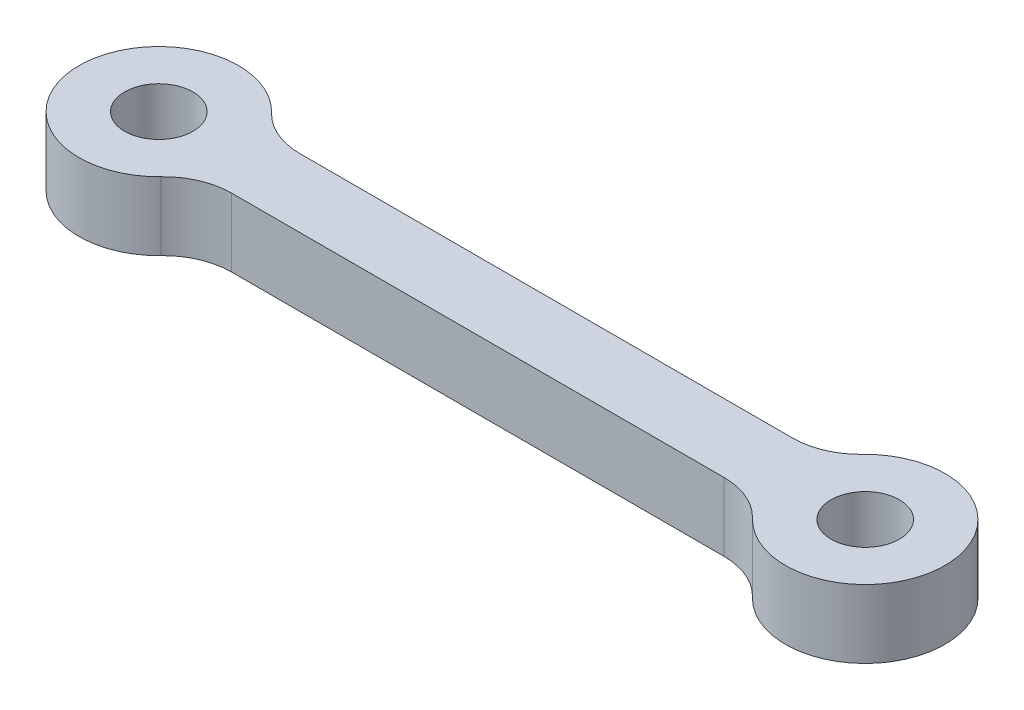
ISO-10303-21;
HEADER;
FILE_DESCRIPTION(('STEP AP214'),'2;1');
FILE_NAME('part.step','',(''),(''),'','','');
FILE_SCHEMA(('AUTOMOTIVE_DESIGN { 1 0 10303 214 1 1 1 1 }'));
ENDSEC;
DATA;
#1=APPLICATION_CONTEXT('core data for automotive mechanical design processes');
#2=APPLICATION_PROTOCOL_DEFINITION('international standard','automotive_design',2000,#1);
#3=PRODUCT_CONTEXT('',#1,'mechanical');
#4=PRODUCT('Part','Part','',(#3));
#5=PRODUCT_RELATED_PRODUCT_CATEGORY('part','',(#4));
#6=PRODUCT_DEFINITION_FORMATION('','',#4);
#7=PRODUCT_DEFINITION_CONTEXT('part definition',#1,'design');
#8=PRODUCT_DEFINITION('design','',#6,#7);
#9=PRODUCT_DEFINITION_SHAPE('','',#8);
#10=(LENGTH_UNIT() NAMED_UNIT(*) SI_UNIT(.MILLI.,.METRE.));
#11=(NAMED_UNIT(*) PLANE_ANGLE_UNIT() SI_UNIT($,.RADIAN.));
#12=(NAMED_UNIT(*) SI_UNIT($,.STERADIAN.) SOLID_ANGLE_UNIT());
#13=UNCERTAINTY_MEASURE_WITH_UNIT(LENGTH_MEASURE(1.E-05),#10,'distance_accuracy_value','');
#14=(GEOMETRIC_REPRESENTATION_CONTEXT(3) GLOBAL_UNCERTAINTY_ASSIGNED_CONTEXT((#13)) GLOBAL_UNIT_ASSIGNED_CONTEXT((#10,
#11,#12)) REPRESENTATION_CONTEXT('',''));
#15=CARTESIAN_POINT('',(0.,0.,0.));
#16=DIRECTION('',(0.,0.,1.));
#17=DIRECTION('',(1.,0.,0.));
#18=AXIS2_PLACEMENT_3D('',#15,#16,#17);
#19=CARTESIAN_POINT('',(31.,3.,0.));
#20=DIRECTION('',(0.,-1.,0.));
#21=DIRECTION('',(0.,0.,-1.));
#22=AXIS2_PLACEMENT_3D('',#19,#20,#21);
#23=CYLINDRICAL_SURFACE('',#22,3.5);
#24=CARTESIAN_POINT('',(31.,3.,0.));
#25=DIRECTION('',(0.,1.,0.));
#26=DIRECTION('',(0.,0.,1.));
#27=AXIS2_PLACEMENT_3D('',#24,#25,#26);
#28=CIRCLE('',#27,3.5);
#29=CARTESIAN_POINT('',(28.4743915139412,3.,2.42307692307692));
#30=VERTEX_POINT('',#29);
#31=CARTESIAN_POINT('',(28.4743915139412,3.,-2.42307692307692));
#32=VERTEX_POINT('',#31);
#33=EDGE_CURVE('E140',#30,#32,#28,.T.);
#34=ORIENTED_EDGE('',*,*,#33,.F.);
#35=DIRECTION('',(0.,-1.,0.));
#36=VECTOR('',#35,1.);
#37=CARTESIAN_POINT('',(28.4743915139412,3.,2.42307692307692));
#38=LINE('',#37,#36);
#39=CARTESIAN_POINT('',(28.4743915139412,0.,2.42307692307692));
#40=VERTEX_POINT('',#39);
#41=EDGE_CURVE('E148',#30,#40,#38,.T.);
#42=ORIENTED_EDGE('',*,*,#41,.T.);
#43=CARTESIAN_POINT('',(31.,0.,0.));
#44=DIRECTION('',(0.,1.,0.));
#45=DIRECTION('',(0.,0.,1.));
#46=AXIS2_PLACEMENT_3D('',#43,#44,#45);
#47=CIRCLE('',#46,3.5);
#48=CARTESIAN_POINT('',(28.4743915139412,0.,-2.42307692307692));
#49=VERTEX_POINT('',#48);
#50=EDGE_CURVE('E165',#40,#49,#47,.T.);
#51=ORIENTED_EDGE('',*,*,#50,.T.);
#52=DIRECTION('',(0.,-1.,0.));
#53=VECTOR('',#52,1.);
#54=CARTESIAN_POINT('',(28.4743915139412,3.,-2.42307692307692));
#55=LINE('',#54,#53);
#56=EDGE_CURVE('E146',#49,#32,#55,.F.);
#57=ORIENTED_EDGE('',*,*,#56,.T.);
#58=EDGE_LOOP('',(#34,#42,#51,#57));
#59=FACE_BOUND('',#58,.T.);
#60=ADVANCED_FACE('F34',(#59),#23,.T.);
#61=CARTESIAN_POINT('',(-14.6957887593287,3.,-1.5));
#62=DIRECTION('',(0.,0.,-1.));
#63=DIRECTION('',(-1.,0.,0.));
#64=AXIS2_PLACEMENT_3D('',#61,#62,#63);
#65=PLANE('',#64);
#66=DIRECTION('',(1.,0.,0.));
#67=VECTOR('',#66,1.);
#68=CARTESIAN_POINT('',(-14.6957887593287,3.,-1.5));
#69=LINE('',#68,#67);
#70=CARTESIAN_POINT('',(4.69041575982343,3.,-1.5));
#71=VERTEX_POINT('',#70);
#72=CARTESIAN_POINT('',(26.3095842401766,3.,-1.5));
#73=VERTEX_POINT('',#72);
#74=EDGE_CURVE('E172',#71,#73,#69,.T.);
#75=ORIENTED_EDGE('',*,*,#74,.T.);
#76=DIRECTION('',(0.,-1.,0.));
#77=VECTOR('',#76,1.);
#78=CARTESIAN_POINT('',(26.3095842401766,3.,-1.5));
#79=LINE('',#78,#77);
#80=CARTESIAN_POINT('',(26.3095842401766,0.,-1.5));
#81=VERTEX_POINT('',#80);
#82=EDGE_CURVE('E111',#73,#81,#79,.T.);
#83=ORIENTED_EDGE('',*,*,#82,.T.);
#84=DIRECTION('',(1.,0.,0.));
#85=VECTOR('',#84,1.);
#86=CARTESIAN_POINT('',(-14.6957887593287,0.,-1.5));
#87=LINE('',#86,#85);
#88=CARTESIAN_POINT('',(4.69041575982343,0.,-1.5));
#89=VERTEX_POINT('',#88);
#90=EDGE_CURVE('E134',#89,#81,#87,.T.);
#91=ORIENTED_EDGE('',*,*,#90,.F.);
#92=DIRECTION('',(0.,-1.,0.));
#93=VECTOR('',#92,1.);
#94=CARTESIAN_POINT('',(4.69041575982343,3.,-1.5));
#95=LINE('',#94,#93);
#96=EDGE_CURVE('E56',#89,#71,#95,.F.);
#97=ORIENTED_EDGE('',*,*,#96,.T.);
#98=EDGE_LOOP('',(#75,#83,#91,#97));
#99=FACE_BOUND('',#98,.T.);
#100=ADVANCED_FACE('F163',(#99),#65,.T.);
#101=CARTESIAN_POINT('',(0.,3.,0.));
#102=DIRECTION('',(0.,-1.,0.));
#103=DIRECTION('',(0.,0.,-1.));
#104=AXIS2_PLACEMENT_3D('',#101,#102,#103);
#105=CYLINDRICAL_SURFACE('',#104,3.5);
#106=CARTESIAN_POINT('',(0.,0.,0.));
#107=DIRECTION('',(0.,1.,0.));
#108=DIRECTION('',(0.,0.,1.));
#109=AXIS2_PLACEMENT_3D('',#106,#107,#108);
#110=CIRCLE('',#109,3.5);
#111=CARTESIAN_POINT('',(2.52560848605877,0.,-2.42307692307692));
#112=VERTEX_POINT('',#111);
#113=CARTESIAN_POINT('',(2.52560848605877,0.,2.42307692307692));
#114=VERTEX_POINT('',#113);
#115=EDGE_CURVE('E129',#112,#114,#110,.T.);
#116=ORIENTED_EDGE('',*,*,#115,.T.);
#117=DIRECTION('',(0.,-1.,0.));
#118=VECTOR('',#117,1.);
#119=CARTESIAN_POINT('',(2.52560848605877,3.,2.42307692307692));
#120=LINE('',#119,#118);
#121=CARTESIAN_POINT('',(2.52560848605877,3.,2.42307692307692));
#122=VERTEX_POINT('',#121);
#123=EDGE_CURVE('E105',#114,#122,#120,.F.);
#124=ORIENTED_EDGE('',*,*,#123,.T.);
#125=CARTESIAN_POINT('',(0.,3.,0.));
#126=DIRECTION('',(0.,1.,0.));
#127=DIRECTION('',(0.,0.,1.));
#128=AXIS2_PLACEMENT_3D('',#125,#126,#127);
#129=CIRCLE('',#128,3.5);
#130=CARTESIAN_POINT('',(2.52560848605877,3.,-2.42307692307692));
#131=VERTEX_POINT('',#130);
#132=EDGE_CURVE('E171',#131,#122,#129,.T.);
#133=ORIENTED_EDGE('',*,*,#132,.F.);
#134=DIRECTION('',(0.,-1.,0.));
#135=VECTOR('',#134,1.);
#136=CARTESIAN_POINT('',(2.52560848605877,3.,-2.42307692307692));
#137=LINE('',#136,#135);
#138=EDGE_CURVE('E121',#131,#112,#137,.T.);
#139=ORIENTED_EDGE('',*,*,#138,.T.);
#140=EDGE_LOOP('',(#116,#124,#133,#139));
#141=FACE_BOUND('',#140,.T.);
#142=ADVANCED_FACE('F174',(#141),#105,.T.);
#143=CARTESIAN_POINT('',(0.,3.,0.));
#144=DIRECTION('',(0.,-1.,0.));
#145=DIRECTION('',(0.,0.,-1.));
#146=AXIS2_PLACEMENT_3D('',#143,#144,#145);
#147=CYLINDRICAL_SURFACE('',#146,1.5);
#148=CARTESIAN_POINT('',(0.,3.,0.));
#149=DIRECTION('',(0.,1.,0.));
#150=DIRECTION('',(0.,0.,1.));
#151=AXIS2_PLACEMENT_3D('',#148,#149,#150);
#152=CIRCLE('',#151,1.5);
#153=CARTESIAN_POINT('',(0.,3.,1.5));
#154=VERTEX_POINT('',#153);
#155=EDGE_CURVE('E176',#154,#154,#152,.T.);
#156=ORIENTED_EDGE('',*,*,#155,.T.);
#157=EDGE_LOOP('',(#156));
#158=FACE_BOUND('',#157,.T.);
#159=CARTESIAN_POINT('',(0.,0.,0.));
#160=DIRECTION('',(0.,1.,0.));
#161=DIRECTION('',(0.,0.,1.));
#162=AXIS2_PLACEMENT_3D('',#159,#160,#161);
#163=CIRCLE('',#162,1.5);
#164=CARTESIAN_POINT('',(0.,0.,1.5));
#165=VERTEX_POINT('',#164);
#166=EDGE_CURVE('E128',#165,#165,#163,.T.);
#167=ORIENTED_EDGE('',*,*,#166,.F.);
#168=EDGE_LOOP('',(#167));
#169=FACE_BOUND('',#168,.T.);
#170=ADVANCED_FACE('F222',(#158,#169),#147,.F.);
#171=CARTESIAN_POINT('',(-14.6957887593287,3.,1.5));
#172=DIRECTION('',(0.,0.,-1.));
#173=DIRECTION('',(-1.,0.,0.));
#174=AXIS2_PLACEMENT_3D('',#171,#172,#173);
#175=PLANE('',#174);
#176=DIRECTION('',(1.,0.,0.));
#177=VECTOR('',#176,1.);
#178=CARTESIAN_POINT('',(-14.6957887593287,3.,1.5));
#179=LINE('',#178,#177);
#180=CARTESIAN_POINT('',(4.69041575982343,3.,1.5));
#181=VERTEX_POINT('',#180);
#182=CARTESIAN_POINT('',(26.3095842401766,3.,1.5));
#183=VERTEX_POINT('',#182);
#184=EDGE_CURVE('E120',#181,#183,#179,.T.);
#185=ORIENTED_EDGE('',*,*,#184,.F.);
#186=DIRECTION('',(0.,1.,0.));
#187=VECTOR('',#186,1.);
#188=CARTESIAN_POINT('',(4.69041575982343,0.,1.5));
#189=LINE('',#188,#187);
#190=CARTESIAN_POINT('',(4.69041575982343,0.,1.5));
#191=VERTEX_POINT('',#190);
#192=EDGE_CURVE('E104',#181,#191,#189,.F.);
#193=ORIENTED_EDGE('',*,*,#192,.T.);
#194=DIRECTION('',(1.,0.,0.));
#195=VECTOR('',#194,1.);
#196=CARTESIAN_POINT('',(-14.6957887593287,0.,1.5));
#197=LINE('',#196,#195);
#198=CARTESIAN_POINT('',(26.3095842401766,0.,1.5));
#199=VERTEX_POINT('',#198);
#200=EDGE_CURVE('E117',#191,#199,#197,.T.);
#201=ORIENTED_EDGE('',*,*,#200,.T.);
#202=DIRECTION('',(0.,1.,0.));
#203=VECTOR('',#202,1.);
#204=CARTESIAN_POINT('',(26.3095842401766,3.,1.5));
#205=LINE('',#204,#203);
#206=EDGE_CURVE('E122',#199,#183,#205,.T.);
#207=ORIENTED_EDGE('',*,*,#206,.T.);
#208=EDGE_LOOP('',(#185,#193,#201,#207));
#209=FACE_BOUND('',#208,.T.);
#210=ADVANCED_FACE('F116',(#209),#175,.F.);
#211=CARTESIAN_POINT('',(31.,3.,0.));
#212=DIRECTION('',(0.,-1.,0.));
#213=DIRECTION('',(0.,0.,-1.));
#214=AXIS2_PLACEMENT_3D('',#211,#212,#213);
#215=CYLINDRICAL_SURFACE('',#214,1.5);
#216=CARTESIAN_POINT('',(31.,3.,0.));
#217=DIRECTION('',(0.,1.,0.));
#218=DIRECTION('',(0.,0.,1.));
#219=AXIS2_PLACEMENT_3D('',#216,#217,#218);
#220=CIRCLE('',#219,1.5);
#221=CARTESIAN_POINT('',(31.,3.,1.5));
#222=VERTEX_POINT('',#221);
#223=EDGE_CURVE('E141',#222,#222,#220,.T.);
#224=ORIENTED_EDGE('',*,*,#223,.T.);
#225=EDGE_LOOP('',(#224));
#226=FACE_BOUND('',#225,.T.);
#227=CARTESIAN_POINT('',(31.,0.,0.));
#228=DIRECTION('',(0.,1.,0.));
#229=DIRECTION('',(0.,0.,1.));
#230=AXIS2_PLACEMENT_3D('',#227,#228,#229);
#231=CIRCLE('',#230,1.5);
#232=CARTESIAN_POINT('',(31.,0.,1.5));
#233=VERTEX_POINT('',#232);
#234=EDGE_CURVE('E132',#233,#233,#231,.T.);
#235=ORIENTED_EDGE('',*,*,#234,.F.);
#236=EDGE_LOOP('',(#235));
#237=FACE_BOUND('',#236,.T.);
#238=ADVANCED_FACE('F216',(#226,#237),#215,.F.);
#239=CARTESIAN_POINT('',(-14.6957887593287,3.,0.));
#240=DIRECTION('',(0.,1.,0.));
#241=DIRECTION('',(0.,0.,1.));
#242=AXIS2_PLACEMENT_3D('',#239,#240,#241);
#243=PLANE('',#242);
#244=ORIENTED_EDGE('',*,*,#184,.T.);
#245=CARTESIAN_POINT('',(26.3095842401766,3.,4.5));
#246=DIRECTION('',(0.,1.,0.));
#247=DIRECTION('',(0.,0.,1.));
#248=AXIS2_PLACEMENT_3D('',#245,#246,#247);
#249=CIRCLE('',#248,3.);
#250=EDGE_CURVE('E156',#183,#30,#249,.F.);
#251=ORIENTED_EDGE('',*,*,#250,.T.);
#252=ORIENTED_EDGE('',*,*,#33,.T.);
#253=CARTESIAN_POINT('',(26.3095842401766,3.,-4.5));
#254=DIRECTION('',(0.,1.,0.));
#255=DIRECTION('',(0.,0.,1.));
#256=AXIS2_PLACEMENT_3D('',#253,#254,#255);
#257=CIRCLE('',#256,3.);
#258=EDGE_CURVE('E49',#32,#73,#257,.F.);
#259=ORIENTED_EDGE('',*,*,#258,.T.);
#260=ORIENTED_EDGE('',*,*,#74,.F.);
#261=CARTESIAN_POINT('',(4.69041575982343,3.,-4.5));
#262=DIRECTION('',(0.,1.,0.));
#263=DIRECTION('',(0.,0.,1.));
#264=AXIS2_PLACEMENT_3D('',#261,#262,#263);
#265=CIRCLE('',#264,3.);
#266=EDGE_CURVE('E11',#71,#131,#265,.F.);
#267=ORIENTED_EDGE('',*,*,#266,.T.);
#268=ORIENTED_EDGE('',*,*,#132,.T.);
#269=CARTESIAN_POINT('',(4.69041575982343,3.,4.5));
#270=DIRECTION('',(0.,1.,0.));
#271=DIRECTION('',(0.,0.,1.));
#272=AXIS2_PLACEMENT_3D('',#269,#270,#271);
#273=CIRCLE('',#272,3.);
#274=EDGE_CURVE('E110',#122,#181,#273,.F.);
#275=ORIENTED_EDGE('',*,*,#274,.T.);
#276=EDGE_LOOP('',(#244,#251,#252,#259,#260,#267,#268,#275));
#277=FACE_BOUND('',#276,.T.);
#278=ORIENTED_EDGE('',*,*,#155,.F.);
#279=EDGE_LOOP('',(#278));
#280=FACE_BOUND('',#279,.T.);
#281=ORIENTED_EDGE('',*,*,#223,.F.);
#282=EDGE_LOOP('',(#281));
#283=FACE_BOUND('',#282,.T.);
#284=ADVANCED_FACE('F169',(#277,#280,#283),#243,.T.);
#285=CARTESIAN_POINT('',(-14.6957887593287,0.,0.));
#286=DIRECTION('',(0.,1.,0.));
#287=DIRECTION('',(0.,0.,1.));
#288=AXIS2_PLACEMENT_3D('',#285,#286,#287);
#289=PLANE('',#288);
#290=ORIENTED_EDGE('',*,*,#50,.F.);
#291=CARTESIAN_POINT('',(26.3095842401766,0.,4.5));
#292=DIRECTION('',(0.,1.,0.));
#293=DIRECTION('',(0.,0.,1.));
#294=AXIS2_PLACEMENT_3D('',#291,#292,#293);
#295=CIRCLE('',#294,3.);
#296=EDGE_CURVE('E127',#40,#199,#295,.T.);
#297=ORIENTED_EDGE('',*,*,#296,.T.);
#298=ORIENTED_EDGE('',*,*,#200,.F.);
#299=CARTESIAN_POINT('',(4.69041575982343,0.,4.5));
#300=DIRECTION('',(0.,1.,0.));
#301=DIRECTION('',(0.,0.,1.));
#302=AXIS2_PLACEMENT_3D('',#299,#300,#301);
#303=CIRCLE('',#302,3.);
#304=EDGE_CURVE('E100',#191,#114,#303,.T.);
#305=ORIENTED_EDGE('',*,*,#304,.T.);
#306=ORIENTED_EDGE('',*,*,#115,.F.);
#307=CARTESIAN_POINT('',(4.69041575982343,0.,-4.5));
#308=DIRECTION('',(0.,1.,0.));
#309=DIRECTION('',(0.,0.,1.));
#310=AXIS2_PLACEMENT_3D('',#307,#308,#309);
#311=CIRCLE('',#310,3.);
#312=EDGE_CURVE('E42',#112,#89,#311,.T.);
#313=ORIENTED_EDGE('',*,*,#312,.T.);
#314=ORIENTED_EDGE('',*,*,#90,.T.);
#315=CARTESIAN_POINT('',(26.3095842401766,0.,-4.5));
#316=DIRECTION('',(0.,1.,0.));
#317=DIRECTION('',(0.,0.,1.));
#318=AXIS2_PLACEMENT_3D('',#315,#316,#317);
#319=CIRCLE('',#318,3.);
#320=EDGE_CURVE('E158',#81,#49,#319,.T.);
#321=ORIENTED_EDGE('',*,*,#320,.T.);
#322=EDGE_LOOP('',(#290,#297,#298,#305,#306,#313,#314,#321));
#323=FACE_BOUND('',#322,.T.);
#324=ORIENTED_EDGE('',*,*,#166,.T.);
#325=EDGE_LOOP('',(#324));
#326=FACE_BOUND('',#325,.T.);
#327=ORIENTED_EDGE('',*,*,#234,.T.);
#328=EDGE_LOOP('',(#327));
#329=FACE_BOUND('',#328,.T.);
#330=ADVANCED_FACE('F125',(#323,#326,#329),#289,.F.);
#331=CARTESIAN_POINT('',(4.69041575982343,3.,4.5));
#332=DIRECTION('',(0.,-1.,0.));
#333=DIRECTION('',(0.,0.,-1.));
#334=AXIS2_PLACEMENT_3D('',#331,#332,#333);
#335=CYLINDRICAL_SURFACE('',#334,3.);
#336=ORIENTED_EDGE('',*,*,#274,.F.);
#337=ORIENTED_EDGE('',*,*,#123,.F.);
#338=ORIENTED_EDGE('',*,*,#304,.F.);
#339=ORIENTED_EDGE('',*,*,#192,.F.);
#340=EDGE_LOOP('',(#336,#337,#338,#339));
#341=FACE_BOUND('',#340,.T.);
#342=ADVANCED_FACE('F103',(#341),#335,.F.);
#343=CARTESIAN_POINT('',(26.3095842401766,3.,4.5));
#344=DIRECTION('',(0.,-1.,0.));
#345=DIRECTION('',(0.,0.,-1.));
#346=AXIS2_PLACEMENT_3D('',#343,#344,#345);
#347=CYLINDRICAL_SURFACE('',#346,3.);
#348=ORIENTED_EDGE('',*,*,#250,.F.);
#349=ORIENTED_EDGE('',*,*,#206,.F.);
#350=ORIENTED_EDGE('',*,*,#296,.F.);
#351=ORIENTED_EDGE('',*,*,#41,.F.);
#352=EDGE_LOOP('',(#348,#349,#350,#351));
#353=FACE_BOUND('',#352,.T.);
#354=ADVANCED_FACE('F193',(#353),#347,.F.);
#355=CARTESIAN_POINT('',(26.3095842401766,3.,-4.5));
#356=DIRECTION('',(0.,-1.,0.));
#357=DIRECTION('',(0.,0.,-1.));
#358=AXIS2_PLACEMENT_3D('',#355,#356,#357);
#359=CYLINDRICAL_SURFACE('',#358,3.);
#360=ORIENTED_EDGE('',*,*,#258,.F.);
#361=ORIENTED_EDGE('',*,*,#56,.F.);
#362=ORIENTED_EDGE('',*,*,#320,.F.);
#363=ORIENTED_EDGE('',*,*,#82,.F.);
#364=EDGE_LOOP('',(#360,#361,#362,#363));
#365=FACE_BOUND('',#364,.T.);
#366=ADVANCED_FACE('F191',(#365),#359,.F.);
#367=CARTESIAN_POINT('',(4.69041575982343,3.,-4.5));
#368=DIRECTION('',(0.,-1.,0.));
#369=DIRECTION('',(0.,0.,-1.));
#370=AXIS2_PLACEMENT_3D('',#367,#368,#369);
#371=CYLINDRICAL_SURFACE('',#370,3.);
#372=ORIENTED_EDGE('',*,*,#266,.F.);
#373=ORIENTED_EDGE('',*,*,#96,.F.);
#374=ORIENTED_EDGE('',*,*,#312,.F.);
#375=ORIENTED_EDGE('',*,*,#138,.F.);
#376=EDGE_LOOP('',(#372,#373,#374,#375));
#377=FACE_BOUND('',#376,.T.);
#378=ADVANCED_FACE('F36',(#377),#371,.F.);
#379=CLOSED_SHELL('',(#60,#100,#142,#170,#210,#238,#284,#330,#342,#354,#366,#378));
#380=MANIFOLD_SOLID_BREP('B2',#379);
#381=ADVANCED_BREP_SHAPE_REPRESENTATION('',(#18,#380),#14);
#382=SHAPE_DEFINITION_REPRESENTATION(#9,#381);
ENDSEC;
END-ISO-10303-21;
